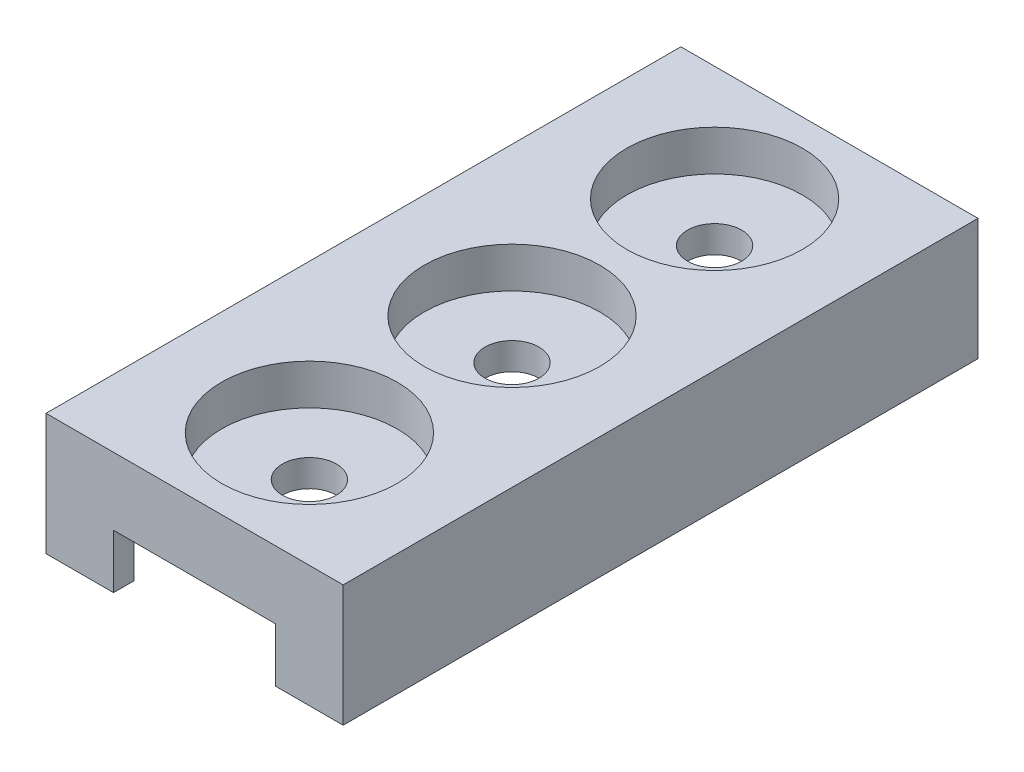
ISO-10303-21;
HEADER;
FILE_DESCRIPTION(('STEP AP214'),'2;1');
FILE_NAME('part.step','',(''),(''),'','','');
FILE_SCHEMA(('AUTOMOTIVE_DESIGN { 1 0 10303 214 1 1 1 1 }'));
ENDSEC;
DATA;
#1=APPLICATION_CONTEXT('core data for automotive mechanical design processes');
#2=APPLICATION_PROTOCOL_DEFINITION('international standard','automotive_design',2000,#1);
#3=PRODUCT_CONTEXT('',#1,'mechanical');
#4=PRODUCT('Part','Part','',(#3));
#5=PRODUCT_RELATED_PRODUCT_CATEGORY('part','',(#4));
#6=PRODUCT_DEFINITION_FORMATION('','',#4);
#7=PRODUCT_DEFINITION_CONTEXT('part definition',#1,'design');
#8=PRODUCT_DEFINITION('design','',#6,#7);
#9=PRODUCT_DEFINITION_SHAPE('','',#8);
#10=(LENGTH_UNIT() NAMED_UNIT(*) SI_UNIT(.MILLI.,.METRE.));
#11=(NAMED_UNIT(*) PLANE_ANGLE_UNIT() SI_UNIT($,.RADIAN.));
#12=(NAMED_UNIT(*) SI_UNIT($,.STERADIAN.) SOLID_ANGLE_UNIT());
#13=UNCERTAINTY_MEASURE_WITH_UNIT(LENGTH_MEASURE(1.E-05),#10,'distance_accuracy_value','');
#14=(GEOMETRIC_REPRESENTATION_CONTEXT(3) GLOBAL_UNCERTAINTY_ASSIGNED_CONTEXT((#13)) GLOBAL_UNIT_ASSIGNED_CONTEXT((#10,
#11,#12)) REPRESENTATION_CONTEXT('',''));
#15=CARTESIAN_POINT('',(0.,0.,0.));
#16=DIRECTION('',(0.,0.,1.));
#17=DIRECTION('',(1.,0.,0.));
#18=AXIS2_PLACEMENT_3D('',#15,#16,#17);
#19=CARTESIAN_POINT('',(0.,-2.,0.));
#20=DIRECTION('',(0.,-1.,0.));
#21=DIRECTION('',(0.,0.,-1.));
#22=AXIS2_PLACEMENT_3D('',#19,#20,#21);
#23=PLANE('',#22);
#24=CARTESIAN_POINT('',(0.,-2.,-15.));
#25=DIRECTION('',(0.,-1.,0.));
#26=DIRECTION('',(0.,0.,-1.));
#27=AXIS2_PLACEMENT_3D('',#24,#25,#26);
#28=CIRCLE('',#27,2.);
#29=CARTESIAN_POINT('',(0.,-2.,-17.));
#30=VERTEX_POINT('',#29);
#31=EDGE_CURVE('E178',#30,#30,#28,.F.);
#32=ORIENTED_EDGE('',*,*,#31,.T.);
#33=EDGE_LOOP('',(#32));
#34=FACE_BOUND('',#33,.T.);
#35=CARTESIAN_POINT('',(-2.10737881233292E-13,-2.,0.));
#36=DIRECTION('',(0.,-1.,0.));
#37=DIRECTION('',(0.,0.,-1.));
#38=AXIS2_PLACEMENT_3D('',#35,#36,#37);
#39=CIRCLE('',#38,2.);
#40=CARTESIAN_POINT('',(-2.10737881233292E-13,-2.,-2.));
#41=VERTEX_POINT('',#40);
#42=EDGE_CURVE('E182',#41,#41,#39,.F.);
#43=ORIENTED_EDGE('',*,*,#42,.T.);
#44=EDGE_LOOP('',(#43));
#45=FACE_BOUND('',#44,.T.);
#46=CARTESIAN_POINT('',(0.,-2.,15.));
#47=DIRECTION('',(0.,-1.,0.));
#48=DIRECTION('',(0.,0.,-1.));
#49=AXIS2_PLACEMENT_3D('',#46,#47,#48);
#50=CIRCLE('',#49,2.);
#51=CARTESIAN_POINT('',(0.,-2.,13.));
#52=VERTEX_POINT('',#51);
#53=EDGE_CURVE('E183',#52,#52,#50,.T.);
#54=ORIENTED_EDGE('',*,*,#53,.F.);
#55=EDGE_LOOP('',(#54));
#56=FACE_BOUND('',#55,.T.);
#57=DIRECTION('',(1.,0.,0.));
#58=VECTOR('',#57,1.);
#59=CARTESIAN_POINT('',(0.,-2.,22.));
#60=LINE('',#59,#58);
#61=CARTESIAN_POINT('',(6.,-2.,22.));
#62=VERTEX_POINT('',#61);
#63=CARTESIAN_POINT('',(9.,-2.,22.));
#64=VERTEX_POINT('',#63);
#65=EDGE_CURVE('E56',#62,#64,#60,.T.);
#66=ORIENTED_EDGE('',*,*,#65,.F.);
#67=DIRECTION('',(0.,0.,-1.));
#68=VECTOR('',#67,1.);
#69=CARTESIAN_POINT('',(6.,-2.,0.));
#70=LINE('',#69,#68);
#71=CARTESIAN_POINT('',(6.,-2.,23.5));
#72=VERTEX_POINT('',#71);
#73=EDGE_CURVE('E60',#72,#62,#70,.T.);
#74=ORIENTED_EDGE('',*,*,#73,.F.);
#75=DIRECTION('',(-1.,0.,0.));
#76=VECTOR('',#75,1.);
#77=CARTESIAN_POINT('',(-11.,-2.,23.5));
#78=LINE('',#77,#76);
#79=CARTESIAN_POINT('',(-6.,-2.,23.5));
#80=VERTEX_POINT('',#79);
#81=EDGE_CURVE('E154',#72,#80,#78,.T.);
#82=ORIENTED_EDGE('',*,*,#81,.T.);
#83=DIRECTION('',(0.,0.,-1.));
#84=VECTOR('',#83,1.);
#85=CARTESIAN_POINT('',(-6.,-2.,0.));
#86=LINE('',#85,#84);
#87=CARTESIAN_POINT('',(-6.,-2.,22.));
#88=VERTEX_POINT('',#87);
#89=EDGE_CURVE('E155',#80,#88,#86,.T.);
#90=ORIENTED_EDGE('',*,*,#89,.T.);
#91=DIRECTION('',(1.,0.,0.));
#92=VECTOR('',#91,1.);
#93=CARTESIAN_POINT('',(0.,-2.,22.));
#94=LINE('',#93,#92);
#95=CARTESIAN_POINT('',(-9.,-2.,22.));
#96=VERTEX_POINT('',#95);
#97=EDGE_CURVE('E157',#96,#88,#94,.T.);
#98=ORIENTED_EDGE('',*,*,#97,.F.);
#99=DIRECTION('',(0.,0.,-1.));
#100=VECTOR('',#99,1.);
#101=CARTESIAN_POINT('',(-9.,-2.,0.));
#102=LINE('',#101,#100);
#103=CARTESIAN_POINT('',(-9.,-2.,-22.));
#104=VERTEX_POINT('',#103);
#105=EDGE_CURVE('E194',#96,#104,#102,.T.);
#106=ORIENTED_EDGE('',*,*,#105,.T.);
#107=DIRECTION('',(1.,0.,0.));
#108=VECTOR('',#107,1.);
#109=CARTESIAN_POINT('',(0.,-2.,-22.));
#110=LINE('',#109,#108);
#111=CARTESIAN_POINT('',(9.,-2.,-22.));
#112=VERTEX_POINT('',#111);
#113=EDGE_CURVE('E198',#104,#112,#110,.T.);
#114=ORIENTED_EDGE('',*,*,#113,.T.);
#115=DIRECTION('',(0.,0.,1.));
#116=VECTOR('',#115,1.);
#117=CARTESIAN_POINT('',(9.,-2.,0.));
#118=LINE('',#117,#116);
#119=EDGE_CURVE('E213',#112,#64,#118,.T.);
#120=ORIENTED_EDGE('',*,*,#119,.T.);
#121=EDGE_LOOP('',(#66,#74,#82,#90,#98,#106,#114,#120));
#122=FACE_BOUND('',#121,.T.);
#123=ADVANCED_FACE('F41',(#34,#45,#56,#122),#23,.T.);
#124=CARTESIAN_POINT('',(9.,-6.,0.));
#125=DIRECTION('',(-1.,0.,0.));
#126=DIRECTION('',(0.,0.,1.));
#127=AXIS2_PLACEMENT_3D('',#124,#125,#126);
#128=PLANE('',#127);
#129=DIRECTION('',(0.,0.,1.));
#130=VECTOR('',#129,1.);
#131=CARTESIAN_POINT('',(9.,-6.,0.));
#132=LINE('',#131,#130);
#133=CARTESIAN_POINT('',(9.,-6.,-22.));
#134=VERTEX_POINT('',#133);
#135=CARTESIAN_POINT('',(9.,-6.,22.));
#136=VERTEX_POINT('',#135);
#137=EDGE_CURVE('E140',#134,#136,#132,.T.);
#138=ORIENTED_EDGE('',*,*,#137,.T.);
#139=DIRECTION('',(0.,1.,0.));
#140=VECTOR('',#139,1.);
#141=CARTESIAN_POINT('',(9.,-6.,22.));
#142=LINE('',#141,#140);
#143=EDGE_CURVE('E159',#136,#64,#142,.T.);
#144=ORIENTED_EDGE('',*,*,#143,.T.);
#145=ORIENTED_EDGE('',*,*,#119,.F.);
#146=DIRECTION('',(0.,1.,0.));
#147=VECTOR('',#146,1.);
#148=CARTESIAN_POINT('',(9.,-6.,-22.));
#149=LINE('',#148,#147);
#150=EDGE_CURVE('E219',#134,#112,#149,.T.);
#151=ORIENTED_EDGE('',*,*,#150,.F.);
#152=EDGE_LOOP('',(#138,#144,#145,#151));
#153=FACE_BOUND('',#152,.T.);
#154=ADVANCED_FACE('F281',(#153),#128,.T.);
#155=CARTESIAN_POINT('',(-9.,-6.,0.));
#156=DIRECTION('',(1.,0.,0.));
#157=DIRECTION('',(0.,0.,-1.));
#158=AXIS2_PLACEMENT_3D('',#155,#156,#157);
#159=PLANE('',#158);
#160=ORIENTED_EDGE('',*,*,#105,.F.);
#161=DIRECTION('',(0.,1.,0.));
#162=VECTOR('',#161,1.);
#163=CARTESIAN_POINT('',(-9.,-6.,22.));
#164=LINE('',#163,#162);
#165=CARTESIAN_POINT('',(-9.,-6.,22.));
#166=VERTEX_POINT('',#165);
#167=EDGE_CURVE('E173',#166,#96,#164,.T.);
#168=ORIENTED_EDGE('',*,*,#167,.F.);
#169=DIRECTION('',(0.,0.,-1.));
#170=VECTOR('',#169,1.);
#171=CARTESIAN_POINT('',(-9.,-6.,0.));
#172=LINE('',#171,#170);
#173=CARTESIAN_POINT('',(-9.,-6.,-22.));
#174=VERTEX_POINT('',#173);
#175=EDGE_CURVE('E197',#166,#174,#172,.T.);
#176=ORIENTED_EDGE('',*,*,#175,.T.);
#177=DIRECTION('',(0.,1.,0.));
#178=VECTOR('',#177,1.);
#179=CARTESIAN_POINT('',(-9.,-6.,-22.));
#180=LINE('',#179,#178);
#181=EDGE_CURVE('E211',#174,#104,#180,.T.);
#182=ORIENTED_EDGE('',*,*,#181,.T.);
#183=EDGE_LOOP('',(#160,#168,#176,#182));
#184=FACE_BOUND('',#183,.T.);
#185=ADVANCED_FACE('F287',(#184),#159,.T.);
#186=CARTESIAN_POINT('',(0.,3.,23.5));
#187=DIRECTION('',(0.,0.,-1.));
#188=DIRECTION('',(-1.,0.,0.));
#189=AXIS2_PLACEMENT_3D('',#186,#187,#188);
#190=PLANE('',#189);
#191=ORIENTED_EDGE('',*,*,#81,.F.);
#192=DIRECTION('',(0.,1.,0.));
#193=VECTOR('',#192,1.);
#194=CARTESIAN_POINT('',(6.,-6.,23.5));
#195=LINE('',#194,#193);
#196=CARTESIAN_POINT('',(6.,-6.,23.5));
#197=VERTEX_POINT('',#196);
#198=EDGE_CURVE('E146',#197,#72,#195,.T.);
#199=ORIENTED_EDGE('',*,*,#198,.F.);
#200=DIRECTION('',(-1.,0.,0.));
#201=VECTOR('',#200,1.);
#202=CARTESIAN_POINT('',(0.,-6.,23.5));
#203=LINE('',#202,#201);
#204=CARTESIAN_POINT('',(11.,-6.,23.5));
#205=VERTEX_POINT('',#204);
#206=EDGE_CURVE('E128',#205,#197,#203,.T.);
#207=ORIENTED_EDGE('',*,*,#206,.F.);
#208=DIRECTION('',(0.,-1.,0.));
#209=VECTOR('',#208,1.);
#210=CARTESIAN_POINT('',(11.,3.,23.5));
#211=LINE('',#210,#209);
#212=CARTESIAN_POINT('',(11.,3.,23.5));
#213=VERTEX_POINT('',#212);
#214=EDGE_CURVE('E11',#213,#205,#211,.T.);
#215=ORIENTED_EDGE('',*,*,#214,.F.);
#216=DIRECTION('',(1.,0.,0.));
#217=VECTOR('',#216,1.);
#218=CARTESIAN_POINT('',(0.,3.,23.5));
#219=LINE('',#218,#217);
#220=CARTESIAN_POINT('',(-11.,3.,23.5));
#221=VERTEX_POINT('',#220);
#222=EDGE_CURVE('E233',#221,#213,#219,.T.);
#223=ORIENTED_EDGE('',*,*,#222,.F.);
#224=DIRECTION('',(0.,-1.,0.));
#225=VECTOR('',#224,1.);
#226=CARTESIAN_POINT('',(-11.,3.,23.5));
#227=LINE('',#226,#225);
#228=CARTESIAN_POINT('',(-11.,-6.,23.5));
#229=VERTEX_POINT('',#228);
#230=EDGE_CURVE('E244',#221,#229,#227,.T.);
#231=ORIENTED_EDGE('',*,*,#230,.T.);
#232=CARTESIAN_POINT('',(-6.,-6.,23.5));
#233=VERTEX_POINT('',#232);
#234=EDGE_CURVE('E142',#233,#229,#203,.T.);
#235=ORIENTED_EDGE('',*,*,#234,.F.);
#236=DIRECTION('',(0.,1.,0.));
#237=VECTOR('',#236,1.);
#238=CARTESIAN_POINT('',(-6.,-6.,23.5));
#239=LINE('',#238,#237);
#240=EDGE_CURVE('E176',#233,#80,#239,.T.);
#241=ORIENTED_EDGE('',*,*,#240,.T.);
#242=EDGE_LOOP('',(#191,#199,#207,#215,#223,#231,#235,#241));
#243=FACE_BOUND('',#242,.T.);
#244=ADVANCED_FACE('F152',(#243),#190,.F.);
#245=CARTESIAN_POINT('',(11.,3.,0.));
#246=DIRECTION('',(-1.,0.,0.));
#247=DIRECTION('',(0.,0.,1.));
#248=AXIS2_PLACEMENT_3D('',#245,#246,#247);
#249=PLANE('',#248);
#250=ORIENTED_EDGE('',*,*,#214,.T.);
#251=DIRECTION('',(0.,0.,1.));
#252=VECTOR('',#251,1.);
#253=CARTESIAN_POINT('',(11.,-6.,0.));
#254=LINE('',#253,#252);
#255=CARTESIAN_POINT('',(11.,-6.,-23.5));
#256=VERTEX_POINT('',#255);
#257=EDGE_CURVE('E136',#256,#205,#254,.T.);
#258=ORIENTED_EDGE('',*,*,#257,.F.);
#259=DIRECTION('',(0.,-1.,0.));
#260=VECTOR('',#259,1.);
#261=CARTESIAN_POINT('',(11.,3.,-23.5));
#262=LINE('',#261,#260);
#263=CARTESIAN_POINT('',(11.,3.,-23.5));
#264=VERTEX_POINT('',#263);
#265=EDGE_CURVE('E49',#264,#256,#262,.T.);
#266=ORIENTED_EDGE('',*,*,#265,.F.);
#267=DIRECTION('',(0.,0.,-1.));
#268=VECTOR('',#267,1.);
#269=CARTESIAN_POINT('',(11.,3.,0.));
#270=LINE('',#269,#268);
#271=EDGE_CURVE('E236',#213,#264,#270,.T.);
#272=ORIENTED_EDGE('',*,*,#271,.F.);
#273=EDGE_LOOP('',(#250,#258,#266,#272));
#274=FACE_BOUND('',#273,.T.);
#275=ADVANCED_FACE('F261',(#274),#249,.F.);
#276=CARTESIAN_POINT('',(0.,3.,-23.5));
#277=DIRECTION('',(0.,0.,-1.));
#278=DIRECTION('',(-1.,0.,0.));
#279=AXIS2_PLACEMENT_3D('',#276,#277,#278);
#280=PLANE('',#279);
#281=ORIENTED_EDGE('',*,*,#265,.T.);
#282=DIRECTION('',(1.,0.,0.));
#283=VECTOR('',#282,1.);
#284=CARTESIAN_POINT('',(0.,-6.,-23.5));
#285=LINE('',#284,#283);
#286=CARTESIAN_POINT('',(-11.,-6.,-23.5));
#287=VERTEX_POINT('',#286);
#288=EDGE_CURVE('E204',#287,#256,#285,.T.);
#289=ORIENTED_EDGE('',*,*,#288,.F.);
#290=DIRECTION('',(0.,-1.,0.));
#291=VECTOR('',#290,1.);
#292=CARTESIAN_POINT('',(-11.,3.,-23.5));
#293=LINE('',#292,#291);
#294=CARTESIAN_POINT('',(-11.,3.,-23.5));
#295=VERTEX_POINT('',#294);
#296=EDGE_CURVE('E253',#295,#287,#293,.T.);
#297=ORIENTED_EDGE('',*,*,#296,.F.);
#298=DIRECTION('',(1.,0.,0.));
#299=VECTOR('',#298,1.);
#300=CARTESIAN_POINT('',(0.,3.,-23.5));
#301=LINE('',#300,#299);
#302=EDGE_CURVE('E238',#295,#264,#301,.T.);
#303=ORIENTED_EDGE('',*,*,#302,.T.);
#304=EDGE_LOOP('',(#281,#289,#297,#303));
#305=FACE_BOUND('',#304,.T.);
#306=ADVANCED_FACE('F257',(#305),#280,.T.);
#307=CARTESIAN_POINT('',(0.,3.,0.));
#308=DIRECTION('',(0.,-1.,0.));
#309=DIRECTION('',(0.,0.,-1.));
#310=AXIS2_PLACEMENT_3D('',#307,#308,#309);
#311=CYLINDRICAL_SURFACE('',#310,6.5);
#312=CARTESIAN_POINT('',(0.,3.,0.));
#313=DIRECTION('',(0.,1.,0.));
#314=DIRECTION('',(0.,0.,1.));
#315=AXIS2_PLACEMENT_3D('',#312,#313,#314);
#316=CIRCLE('',#315,6.5);
#317=CARTESIAN_POINT('',(0.,3.,6.5));
#318=VERTEX_POINT('',#317);
#319=EDGE_CURVE('E230',#318,#318,#316,.T.);
#320=ORIENTED_EDGE('',*,*,#319,.T.);
#321=EDGE_LOOP('',(#320));
#322=FACE_BOUND('',#321,.T.);
#323=CARTESIAN_POINT('',(0.,0.,0.));
#324=DIRECTION('',(0.,1.,0.));
#325=DIRECTION('',(0.,0.,1.));
#326=AXIS2_PLACEMENT_3D('',#323,#324,#325);
#327=CIRCLE('',#326,6.5);
#328=CARTESIAN_POINT('',(0.,0.,6.5));
#329=VERTEX_POINT('',#328);
#330=EDGE_CURVE('E227',#329,#329,#327,.T.);
#331=ORIENTED_EDGE('',*,*,#330,.F.);
#332=EDGE_LOOP('',(#331));
#333=FACE_BOUND('',#332,.T.);
#334=ADVANCED_FACE('F314',(#322,#333),#311,.F.);
#335=CARTESIAN_POINT('',(0.,3.,-15.));
#336=DIRECTION('',(0.,-1.,0.));
#337=DIRECTION('',(0.,0.,-1.));
#338=AXIS2_PLACEMENT_3D('',#335,#336,#337);
#339=CYLINDRICAL_SURFACE('',#338,6.5);
#340=CARTESIAN_POINT('',(0.,3.,-15.));
#341=DIRECTION('',(0.,1.,0.));
#342=DIRECTION('',(0.,0.,1.));
#343=AXIS2_PLACEMENT_3D('',#340,#341,#342);
#344=CIRCLE('',#343,6.5);
#345=CARTESIAN_POINT('',(0.,3.,-8.5));
#346=VERTEX_POINT('',#345);
#347=EDGE_CURVE('E226',#346,#346,#344,.T.);
#348=ORIENTED_EDGE('',*,*,#347,.T.);
#349=EDGE_LOOP('',(#348));
#350=FACE_BOUND('',#349,.T.);
#351=CARTESIAN_POINT('',(0.,0.,-15.));
#352=DIRECTION('',(0.,1.,0.));
#353=DIRECTION('',(0.,0.,1.));
#354=AXIS2_PLACEMENT_3D('',#351,#352,#353);
#355=CIRCLE('',#354,6.5);
#356=CARTESIAN_POINT('',(0.,0.,-8.5));
#357=VERTEX_POINT('',#356);
#358=EDGE_CURVE('E247',#357,#357,#355,.T.);
#359=ORIENTED_EDGE('',*,*,#358,.F.);
#360=EDGE_LOOP('',(#359));
#361=FACE_BOUND('',#360,.T.);
#362=ADVANCED_FACE('F277',(#350,#361),#339,.F.);
#363=CARTESIAN_POINT('',(0.,3.,15.));
#364=DIRECTION('',(0.,-1.,0.));
#365=DIRECTION('',(0.,0.,-1.));
#366=AXIS2_PLACEMENT_3D('',#363,#364,#365);
#367=CYLINDRICAL_SURFACE('',#366,6.5);
#368=CARTESIAN_POINT('',(0.,3.,15.));
#369=DIRECTION('',(0.,1.,0.));
#370=DIRECTION('',(0.,0.,1.));
#371=AXIS2_PLACEMENT_3D('',#368,#369,#370);
#372=CIRCLE('',#371,6.5);
#373=CARTESIAN_POINT('',(0.,3.,21.5));
#374=VERTEX_POINT('',#373);
#375=EDGE_CURVE('E223',#374,#374,#372,.T.);
#376=ORIENTED_EDGE('',*,*,#375,.T.);
#377=EDGE_LOOP('',(#376));
#378=FACE_BOUND('',#377,.T.);
#379=CARTESIAN_POINT('',(0.,0.,15.));
#380=DIRECTION('',(0.,1.,0.));
#381=DIRECTION('',(0.,0.,1.));
#382=AXIS2_PLACEMENT_3D('',#379,#380,#381);
#383=CIRCLE('',#382,6.5);
#384=CARTESIAN_POINT('',(0.,0.,21.5));
#385=VERTEX_POINT('',#384);
#386=EDGE_CURVE('E222',#385,#385,#383,.T.);
#387=ORIENTED_EDGE('',*,*,#386,.F.);
#388=EDGE_LOOP('',(#387));
#389=FACE_BOUND('',#388,.T.);
#390=ADVANCED_FACE('F43',(#378,#389),#367,.F.);
#391=CARTESIAN_POINT('',(-11.,3.,0.));
#392=DIRECTION('',(-1.,0.,0.));
#393=DIRECTION('',(0.,0.,1.));
#394=AXIS2_PLACEMENT_3D('',#391,#392,#393);
#395=PLANE('',#394);
#396=ORIENTED_EDGE('',*,*,#296,.T.);
#397=DIRECTION('',(0.,0.,-1.));
#398=VECTOR('',#397,1.);
#399=CARTESIAN_POINT('',(-11.,-6.,0.));
#400=LINE('',#399,#398);
#401=EDGE_CURVE('E201',#229,#287,#400,.T.);
#402=ORIENTED_EDGE('',*,*,#401,.F.);
#403=ORIENTED_EDGE('',*,*,#230,.F.);
#404=DIRECTION('',(0.,0.,-1.));
#405=VECTOR('',#404,1.);
#406=CARTESIAN_POINT('',(-11.,3.,0.));
#407=LINE('',#406,#405);
#408=EDGE_CURVE('E241',#221,#295,#407,.T.);
#409=ORIENTED_EDGE('',*,*,#408,.T.);
#410=EDGE_LOOP('',(#396,#402,#403,#409));
#411=FACE_BOUND('',#410,.T.);
#412=ADVANCED_FACE('F267',(#411),#395,.T.);
#413=CARTESIAN_POINT('',(0.,3.,0.));
#414=DIRECTION('',(0.,1.,0.));
#415=DIRECTION('',(0.,0.,1.));
#416=AXIS2_PLACEMENT_3D('',#413,#414,#415);
#417=PLANE('',#416);
#418=ORIENTED_EDGE('',*,*,#375,.F.);
#419=EDGE_LOOP('',(#418));
#420=FACE_BOUND('',#419,.T.);
#421=ORIENTED_EDGE('',*,*,#347,.F.);
#422=EDGE_LOOP('',(#421));
#423=FACE_BOUND('',#422,.T.);
#424=ORIENTED_EDGE('',*,*,#319,.F.);
#425=EDGE_LOOP('',(#424));
#426=FACE_BOUND('',#425,.T.);
#427=ORIENTED_EDGE('',*,*,#222,.T.);
#428=ORIENTED_EDGE('',*,*,#271,.T.);
#429=ORIENTED_EDGE('',*,*,#302,.F.);
#430=ORIENTED_EDGE('',*,*,#408,.F.);
#431=EDGE_LOOP('',(#427,#428,#429,#430));
#432=FACE_BOUND('',#431,.T.);
#433=ADVANCED_FACE('F265',(#420,#423,#426,#432),#417,.T.);
#434=CARTESIAN_POINT('',(0.,0.,0.));
#435=DIRECTION('',(0.,-1.,0.));
#436=DIRECTION('',(0.,0.,-1.));
#437=AXIS2_PLACEMENT_3D('',#434,#435,#436);
#438=PLANE('',#437);
#439=CARTESIAN_POINT('',(-2.10737881233292E-13,0.,0.));
#440=DIRECTION('',(0.,-1.,0.));
#441=DIRECTION('',(0.,0.,-1.));
#442=AXIS2_PLACEMENT_3D('',#439,#440,#441);
#443=CIRCLE('',#442,2.);
#444=CARTESIAN_POINT('',(-2.10737881233292E-13,0.,-2.));
#445=VERTEX_POINT('',#444);
#446=EDGE_CURVE('E191',#445,#445,#443,.F.);
#447=ORIENTED_EDGE('',*,*,#446,.F.);
#448=EDGE_LOOP('',(#447));
#449=FACE_BOUND('',#448,.T.);
#450=ORIENTED_EDGE('',*,*,#330,.T.);
#451=EDGE_LOOP('',(#450));
#452=FACE_BOUND('',#451,.T.);
#453=ADVANCED_FACE('F274',(#449,#452),#438,.F.);
#454=CARTESIAN_POINT('',(0.,0.,-15.));
#455=DIRECTION('',(0.,-1.,0.));
#456=DIRECTION('',(0.,0.,-1.));
#457=AXIS2_PLACEMENT_3D('',#454,#455,#456);
#458=CIRCLE('',#457,2.);
#459=CARTESIAN_POINT('',(0.,0.,-17.));
#460=VERTEX_POINT('',#459);
#461=EDGE_CURVE('E186',#460,#460,#458,.F.);
#462=ORIENTED_EDGE('',*,*,#461,.F.);
#463=EDGE_LOOP('',(#462));
#464=FACE_BOUND('',#463,.T.);
#465=ORIENTED_EDGE('',*,*,#358,.T.);
#466=EDGE_LOOP('',(#465));
#467=FACE_BOUND('',#466,.T.);
#468=ADVANCED_FACE('F296',(#464,#467),#438,.F.);
#469=CARTESIAN_POINT('',(0.,0.,15.));
#470=DIRECTION('',(0.,-1.,0.));
#471=DIRECTION('',(0.,0.,-1.));
#472=AXIS2_PLACEMENT_3D('',#469,#470,#471);
#473=CIRCLE('',#472,2.);
#474=CARTESIAN_POINT('',(0.,0.,13.));
#475=VERTEX_POINT('',#474);
#476=EDGE_CURVE('E179',#475,#475,#473,.T.);
#477=ORIENTED_EDGE('',*,*,#476,.T.);
#478=EDGE_LOOP('',(#477));
#479=FACE_BOUND('',#478,.T.);
#480=ORIENTED_EDGE('',*,*,#386,.T.);
#481=EDGE_LOOP('',(#480));
#482=FACE_BOUND('',#481,.T.);
#483=ADVANCED_FACE('F293',(#479,#482),#438,.F.);
#484=CARTESIAN_POINT('',(0.,-6.,-22.));
#485=DIRECTION('',(0.,0.,1.));
#486=DIRECTION('',(1.,0.,0.));
#487=AXIS2_PLACEMENT_3D('',#484,#485,#486);
#488=PLANE('',#487);
#489=ORIENTED_EDGE('',*,*,#113,.F.);
#490=ORIENTED_EDGE('',*,*,#181,.F.);
#491=DIRECTION('',(1.,0.,0.));
#492=VECTOR('',#491,1.);
#493=CARTESIAN_POINT('',(0.,-6.,-22.));
#494=LINE('',#493,#492);
#495=EDGE_CURVE('E208',#174,#134,#494,.T.);
#496=ORIENTED_EDGE('',*,*,#495,.T.);
#497=ORIENTED_EDGE('',*,*,#150,.T.);
#498=EDGE_LOOP('',(#489,#490,#496,#497));
#499=FACE_BOUND('',#498,.T.);
#500=ADVANCED_FACE('F295',(#499),#488,.T.);
#501=CARTESIAN_POINT('',(0.,-6.,0.));
#502=DIRECTION('',(0.,-1.,0.));
#503=DIRECTION('',(0.,0.,-1.));
#504=AXIS2_PLACEMENT_3D('',#501,#502,#503);
#505=PLANE('',#504);
#506=ORIENTED_EDGE('',*,*,#175,.F.);
#507=DIRECTION('',(1.,0.,0.));
#508=VECTOR('',#507,1.);
#509=CARTESIAN_POINT('',(0.,-6.,22.));
#510=LINE('',#509,#508);
#511=CARTESIAN_POINT('',(-6.,-6.,22.));
#512=VERTEX_POINT('',#511);
#513=EDGE_CURVE('E166',#166,#512,#510,.T.);
#514=ORIENTED_EDGE('',*,*,#513,.T.);
#515=DIRECTION('',(0.,0.,-1.));
#516=VECTOR('',#515,1.);
#517=CARTESIAN_POINT('',(-6.,-6.,0.));
#518=LINE('',#517,#516);
#519=EDGE_CURVE('E163',#233,#512,#518,.T.);
#520=ORIENTED_EDGE('',*,*,#519,.F.);
#521=ORIENTED_EDGE('',*,*,#234,.T.);
#522=ORIENTED_EDGE('',*,*,#401,.T.);
#523=ORIENTED_EDGE('',*,*,#288,.T.);
#524=ORIENTED_EDGE('',*,*,#257,.T.);
#525=ORIENTED_EDGE('',*,*,#206,.T.);
#526=DIRECTION('',(0.,0.,-1.));
#527=VECTOR('',#526,1.);
#528=CARTESIAN_POINT('',(6.,-6.,0.));
#529=LINE('',#528,#527);
#530=CARTESIAN_POINT('',(6.,-6.,22.));
#531=VERTEX_POINT('',#530);
#532=EDGE_CURVE('E132',#197,#531,#529,.T.);
#533=ORIENTED_EDGE('',*,*,#532,.T.);
#534=DIRECTION('',(1.,0.,0.));
#535=VECTOR('',#534,1.);
#536=CARTESIAN_POINT('',(0.,-6.,22.));
#537=LINE('',#536,#535);
#538=EDGE_CURVE('E150',#531,#136,#537,.T.);
#539=ORIENTED_EDGE('',*,*,#538,.T.);
#540=ORIENTED_EDGE('',*,*,#137,.F.);
#541=ORIENTED_EDGE('',*,*,#495,.F.);
#542=EDGE_LOOP('',(#506,#514,#520,#521,#522,#523,#524,#525,#533,#539,#540,#541));
#543=FACE_BOUND('',#542,.T.);
#544=ADVANCED_FACE('F130',(#543),#505,.T.);
#545=CARTESIAN_POINT('',(-2.10737881233292E-13,0.,0.));
#546=DIRECTION('',(0.,-1.,0.));
#547=DIRECTION('',(0.,0.,-1.));
#548=AXIS2_PLACEMENT_3D('',#545,#546,#547);
#549=CYLINDRICAL_SURFACE('',#548,2.);
#550=ORIENTED_EDGE('',*,*,#446,.T.);
#551=EDGE_LOOP('',(#550));
#552=FACE_BOUND('',#551,.T.);
#553=ORIENTED_EDGE('',*,*,#42,.F.);
#554=EDGE_LOOP('',(#553));
#555=FACE_BOUND('',#554,.T.);
#556=ADVANCED_FACE('F372',(#552,#555),#549,.F.);
#557=CARTESIAN_POINT('',(0.,0.,15.));
#558=DIRECTION('',(0.,-1.,0.));
#559=DIRECTION('',(0.,0.,-1.));
#560=AXIS2_PLACEMENT_3D('',#557,#558,#559);
#561=CYLINDRICAL_SURFACE('',#560,2.);
#562=ORIENTED_EDGE('',*,*,#476,.F.);
#563=EDGE_LOOP('',(#562));
#564=FACE_BOUND('',#563,.T.);
#565=ORIENTED_EDGE('',*,*,#53,.T.);
#566=EDGE_LOOP('',(#565));
#567=FACE_BOUND('',#566,.T.);
#568=ADVANCED_FACE('F377',(#564,#567),#561,.F.);
#569=CARTESIAN_POINT('',(0.,0.,-15.));
#570=DIRECTION('',(0.,-1.,0.));
#571=DIRECTION('',(0.,0.,-1.));
#572=AXIS2_PLACEMENT_3D('',#569,#570,#571);
#573=CYLINDRICAL_SURFACE('',#572,2.);
#574=ORIENTED_EDGE('',*,*,#461,.T.);
#575=EDGE_LOOP('',(#574));
#576=FACE_BOUND('',#575,.T.);
#577=ORIENTED_EDGE('',*,*,#31,.F.);
#578=EDGE_LOOP('',(#577));
#579=FACE_BOUND('',#578,.T.);
#580=ADVANCED_FACE('F387',(#576,#579),#573,.F.);
#581=CARTESIAN_POINT('',(-6.,-6.,0.));
#582=DIRECTION('',(1.,0.,0.));
#583=DIRECTION('',(0.,0.,-1.));
#584=AXIS2_PLACEMENT_3D('',#581,#582,#583);
#585=PLANE('',#584);
#586=ORIENTED_EDGE('',*,*,#89,.F.);
#587=ORIENTED_EDGE('',*,*,#240,.F.);
#588=ORIENTED_EDGE('',*,*,#519,.T.);
#589=DIRECTION('',(0.,1.,0.));
#590=VECTOR('',#589,1.);
#591=CARTESIAN_POINT('',(-6.,-6.,22.));
#592=LINE('',#591,#590);
#593=EDGE_CURVE('E167',#512,#88,#592,.T.);
#594=ORIENTED_EDGE('',*,*,#593,.T.);
#595=EDGE_LOOP('',(#586,#587,#588,#594));
#596=FACE_BOUND('',#595,.T.);
#597=ADVANCED_FACE('F396',(#596),#585,.T.);
#598=CARTESIAN_POINT('',(0.,-6.,22.));
#599=DIRECTION('',(0.,0.,1.));
#600=DIRECTION('',(1.,0.,0.));
#601=AXIS2_PLACEMENT_3D('',#598,#599,#600);
#602=PLANE('',#601);
#603=ORIENTED_EDGE('',*,*,#97,.T.);
#604=ORIENTED_EDGE('',*,*,#593,.F.);
#605=ORIENTED_EDGE('',*,*,#513,.F.);
#606=ORIENTED_EDGE('',*,*,#167,.T.);
#607=EDGE_LOOP('',(#603,#604,#605,#606));
#608=FACE_BOUND('',#607,.T.);
#609=ADVANCED_FACE('F443',(#608),#602,.F.);
#610=CARTESIAN_POINT('',(6.,-6.,0.));
#611=DIRECTION('',(1.,0.,0.));
#612=DIRECTION('',(0.,0.,-1.));
#613=AXIS2_PLACEMENT_3D('',#610,#611,#612);
#614=PLANE('',#613);
#615=ORIENTED_EDGE('',*,*,#73,.T.);
#616=DIRECTION('',(0.,1.,0.));
#617=VECTOR('',#616,1.);
#618=CARTESIAN_POINT('',(6.,-6.,22.));
#619=LINE('',#618,#617);
#620=EDGE_CURVE('E148',#531,#62,#619,.T.);
#621=ORIENTED_EDGE('',*,*,#620,.F.);
#622=ORIENTED_EDGE('',*,*,#532,.F.);
#623=ORIENTED_EDGE('',*,*,#198,.T.);
#624=EDGE_LOOP('',(#615,#621,#622,#623));
#625=FACE_BOUND('',#624,.T.);
#626=ADVANCED_FACE('F145',(#625),#614,.F.);
#627=CARTESIAN_POINT('',(0.,-6.,22.));
#628=DIRECTION('',(0.,0.,1.));
#629=DIRECTION('',(1.,0.,0.));
#630=AXIS2_PLACEMENT_3D('',#627,#628,#629);
#631=PLANE('',#630);
#632=ORIENTED_EDGE('',*,*,#65,.T.);
#633=ORIENTED_EDGE('',*,*,#143,.F.);
#634=ORIENTED_EDGE('',*,*,#538,.F.);
#635=ORIENTED_EDGE('',*,*,#620,.T.);
#636=EDGE_LOOP('',(#632,#633,#634,#635));
#637=FACE_BOUND('',#636,.T.);
#638=ADVANCED_FACE('F465',(#637),#631,.F.);
#639=CLOSED_SHELL('',(#123,#154,#185,#244,#275,#306,#334,#362,#390,#412,#433,#453,#468,#483,
#500,#544,#556,#568,#580,#597,#609,#626,#638));
#640=MANIFOLD_SOLID_BREP('B2',#639);
#641=ADVANCED_BREP_SHAPE_REPRESENTATION('',(#18,#640),#14);
#642=SHAPE_DEFINITION_REPRESENTATION(#9,#641);
ENDSEC;
END-ISO-10303-21;
